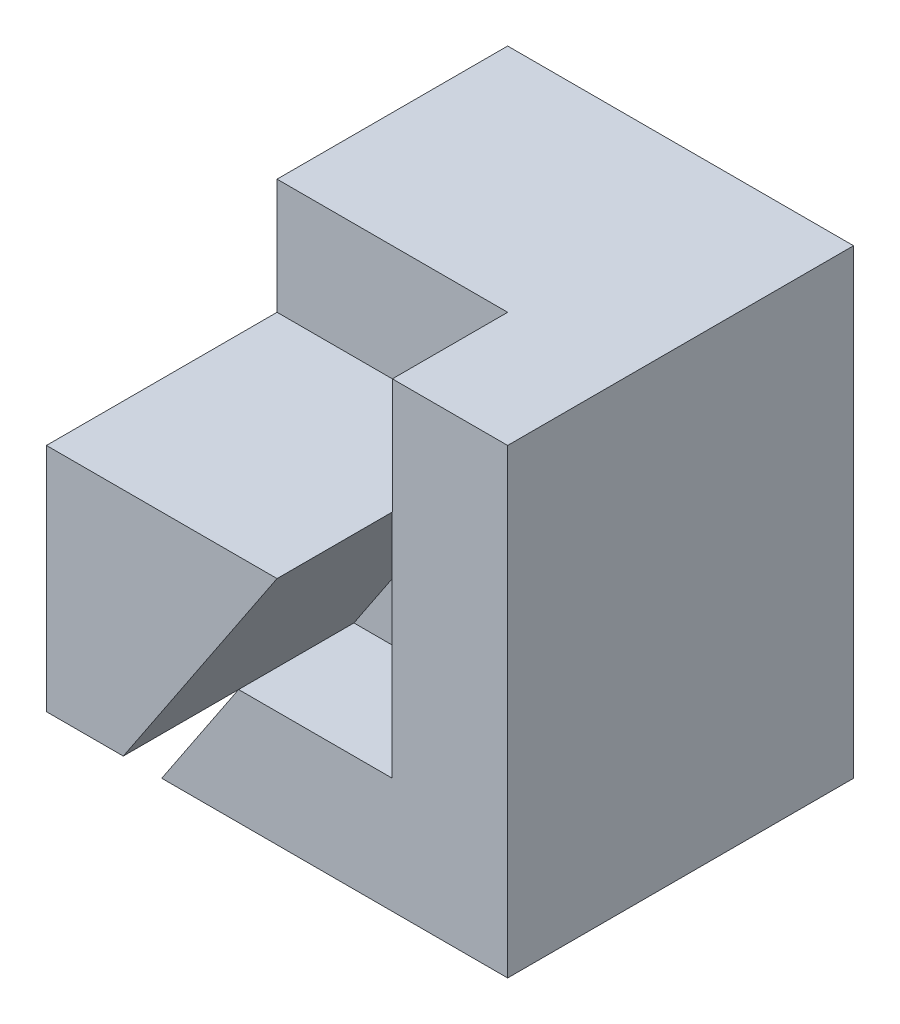
ISO-10303-21;
HEADER;
FILE_DESCRIPTION(('STEP AP214'),'2;1');
FILE_NAME('part.step','',(''),(''),'','','');
FILE_SCHEMA(('AUTOMOTIVE_DESIGN { 1 0 10303 214 1 1 1 1 }'));
ENDSEC;
DATA;
#1=APPLICATION_CONTEXT('core data for automotive mechanical design processes');
#2=APPLICATION_PROTOCOL_DEFINITION('international standard','automotive_design',2000,#1);
#3=PRODUCT_CONTEXT('',#1,'mechanical');
#4=PRODUCT('Part','Part','',(#3));
#5=PRODUCT_RELATED_PRODUCT_CATEGORY('part','',(#4));
#6=PRODUCT_DEFINITION_FORMATION('','',#4);
#7=PRODUCT_DEFINITION_CONTEXT('part definition',#1,'design');
#8=PRODUCT_DEFINITION('design','',#6,#7);
#9=PRODUCT_DEFINITION_SHAPE('','',#8);
#10=(LENGTH_UNIT() NAMED_UNIT(*) SI_UNIT(.MILLI.,.METRE.));
#11=(NAMED_UNIT(*) PLANE_ANGLE_UNIT() SI_UNIT($,.RADIAN.));
#12=(NAMED_UNIT(*) SI_UNIT($,.STERADIAN.) SOLID_ANGLE_UNIT());
#13=UNCERTAINTY_MEASURE_WITH_UNIT(LENGTH_MEASURE(1.E-05),#10,'distance_accuracy_value','');
#14=(GEOMETRIC_REPRESENTATION_CONTEXT(3) GLOBAL_UNCERTAINTY_ASSIGNED_CONTEXT((#13)) GLOBAL_UNIT_ASSIGNED_CONTEXT((#10,
#11,#12)) REPRESENTATION_CONTEXT('',''));
#15=CARTESIAN_POINT('',(0.,0.,0.));
#16=DIRECTION('',(0.,0.,1.));
#17=DIRECTION('',(1.,0.,0.));
#18=AXIS2_PLACEMENT_3D('',#15,#16,#17);
#19=CARTESIAN_POINT('',(40.,0.,30.));
#20=DIRECTION('',(0.,0.,-1.));
#21=DIRECTION('',(-1.,0.,0.));
#22=AXIS2_PLACEMENT_3D('',#19,#20,#21);
#23=PLANE('',#22);
#24=DIRECTION('',(0.554700196225229,0.832050294337844,0.));
#25=VECTOR('',#24,1.);
#26=CARTESIAN_POINT('',(16.6666666666667,10.,30.));
#27=LINE('',#26,#25);
#28=CARTESIAN_POINT('',(29.9666666666667,29.95,30.));
#29=VERTEX_POINT('',#28);
#30=CARTESIAN_POINT('',(30.,30.,30.));
#31=VERTEX_POINT('',#30);
#32=EDGE_CURVE('E173',#29,#31,#27,.T.);
#33=ORIENTED_EDGE('',*,*,#32,.F.);
#34=DIRECTION('',(0.,-1.,0.));
#35=VECTOR('',#34,1.);
#36=CARTESIAN_POINT('',(29.9666666666667,29.95,30.));
#37=LINE('',#36,#35);
#38=CARTESIAN_POINT('',(29.9666666666667,10.,30.));
#39=VERTEX_POINT('',#38);
#40=EDGE_CURVE('E183',#29,#39,#37,.T.);
#41=ORIENTED_EDGE('',*,*,#40,.T.);
#42=DIRECTION('',(1.,0.,0.));
#43=VECTOR('',#42,1.);
#44=CARTESIAN_POINT('',(30.,10.,30.));
#45=LINE('',#44,#43);
#46=CARTESIAN_POINT('',(16.6666666666667,10.,30.));
#47=VERTEX_POINT('',#46);
#48=EDGE_CURVE('E208',#47,#39,#45,.T.);
#49=ORIENTED_EDGE('',*,*,#48,.F.);
#50=DIRECTION('',(0.554700196225229,0.832050294337844,0.));
#51=VECTOR('',#50,1.);
#52=CARTESIAN_POINT('',(6.92307692307693,-4.61538461538461,30.));
#53=LINE('',#52,#51);
#54=CARTESIAN_POINT('',(16.666,9.99900000000001,30.));
#55=VERTEX_POINT('',#54);
#56=EDGE_CURVE('E197',#55,#47,#53,.T.);
#57=ORIENTED_EDGE('',*,*,#56,.F.);
#58=CARTESIAN_POINT('',(10.,0.,30.));
#59=VERTEX_POINT('',#58);
#60=EDGE_CURVE('E155',#59,#55,#53,.T.);
#61=ORIENTED_EDGE('',*,*,#60,.F.);
#62=DIRECTION('',(-1.,0.,0.));
#63=VECTOR('',#62,1.);
#64=CARTESIAN_POINT('',(40.,0.,30.));
#65=LINE('',#64,#63);
#66=CARTESIAN_POINT('',(40.,0.,30.));
#67=VERTEX_POINT('',#66);
#68=EDGE_CURVE('E251',#67,#59,#65,.T.);
#69=ORIENTED_EDGE('',*,*,#68,.F.);
#70=DIRECTION('',(0.,1.,0.));
#71=VECTOR('',#70,1.);
#72=CARTESIAN_POINT('',(40.,0.,30.));
#73=LINE('',#72,#71);
#74=CARTESIAN_POINT('',(40.,40.,30.));
#75=VERTEX_POINT('',#74);
#76=EDGE_CURVE('E254',#67,#75,#73,.T.);
#77=ORIENTED_EDGE('',*,*,#76,.T.);
#78=DIRECTION('',(-1.,0.,0.));
#79=VECTOR('',#78,1.);
#80=CARTESIAN_POINT('',(40.,40.,30.));
#81=LINE('',#80,#79);
#82=CARTESIAN_POINT('',(30.,40.,30.));
#83=VERTEX_POINT('',#82);
#84=EDGE_CURVE('E248',#75,#83,#81,.T.);
#85=ORIENTED_EDGE('',*,*,#84,.T.);
#86=DIRECTION('',(0.,1.,0.));
#87=VECTOR('',#86,1.);
#88=CARTESIAN_POINT('',(30.,0.,30.));
#89=LINE('',#88,#87);
#90=EDGE_CURVE('E257',#31,#83,#89,.T.);
#91=ORIENTED_EDGE('',*,*,#90,.F.);
#92=EDGE_LOOP('',(#33,#41,#49,#57,#61,#69,#77,#85,#91));
#93=FACE_BOUND('',#92,.T.);
#94=ADVANCED_FACE('F35',(#93),#23,.F.);
#95=CARTESIAN_POINT('',(10.,30.,30.));
#96=DIRECTION('',(0.,-1.,0.));
#97=DIRECTION('',(0.,0.,-1.));
#98=AXIS2_PLACEMENT_3D('',#95,#96,#97);
#99=PLANE('',#98);
#100=DIRECTION('',(0.,0.,-1.));
#101=VECTOR('',#100,1.);
#102=CARTESIAN_POINT('',(10.,30.,30.));
#103=LINE('',#102,#101);
#104=CARTESIAN_POINT('',(10.,30.,40.));
#105=VERTEX_POINT('',#104);
#106=CARTESIAN_POINT('',(10.,30.,20.));
#107=VERTEX_POINT('',#106);
#108=EDGE_CURVE('E58',#105,#107,#103,.T.);
#109=ORIENTED_EDGE('',*,*,#108,.F.);
#110=DIRECTION('',(-1.,0.,0.));
#111=VECTOR('',#110,1.);
#112=CARTESIAN_POINT('',(30.,30.,40.));
#113=LINE('',#112,#111);
#114=CARTESIAN_POINT('',(30.,30.,40.));
#115=VERTEX_POINT('',#114);
#116=EDGE_CURVE('E175',#115,#105,#113,.T.);
#117=ORIENTED_EDGE('',*,*,#116,.F.);
#118=DIRECTION('',(0.,0.,-1.));
#119=VECTOR('',#118,1.);
#120=CARTESIAN_POINT('',(30.,30.,40.));
#121=LINE('',#120,#119);
#122=EDGE_CURVE('E178',#115,#31,#121,.T.);
#123=ORIENTED_EDGE('',*,*,#122,.T.);
#124=DIRECTION('',(0.,0.,-1.));
#125=VECTOR('',#124,1.);
#126=CARTESIAN_POINT('',(30.,30.,30.));
#127=LINE('',#126,#125);
#128=CARTESIAN_POINT('',(30.,30.,20.));
#129=VERTEX_POINT('',#128);
#130=EDGE_CURVE('E216',#31,#129,#127,.T.);
#131=ORIENTED_EDGE('',*,*,#130,.T.);
#132=DIRECTION('',(-1.,0.,0.));
#133=VECTOR('',#132,1.);
#134=CARTESIAN_POINT('',(10.,30.,20.));
#135=LINE('',#134,#133);
#136=EDGE_CURVE('E212',#129,#107,#135,.T.);
#137=ORIENTED_EDGE('',*,*,#136,.T.);
#138=EDGE_LOOP('',(#109,#117,#123,#131,#137));
#139=FACE_BOUND('',#138,.T.);
#140=ADVANCED_FACE('F332',(#139),#99,.F.);
#141=CARTESIAN_POINT('',(0.,0.,40.));
#142=DIRECTION('',(0.,0.,-1.));
#143=DIRECTION('',(-1.,0.,0.));
#144=AXIS2_PLACEMENT_3D('',#141,#142,#143);
#145=PLANE('',#144);
#146=DIRECTION('',(0.,-1.,0.));
#147=VECTOR('',#146,1.);
#148=CARTESIAN_POINT('',(10.,0.,40.));
#149=LINE('',#148,#147);
#150=CARTESIAN_POINT('',(10.,9.999,40.));
#151=VERTEX_POINT('',#150);
#152=EDGE_CURVE('E203',#105,#151,#149,.T.);
#153=ORIENTED_EDGE('',*,*,#152,.T.);
#154=DIRECTION('',(-1.,0.,0.));
#155=VECTOR('',#154,1.);
#156=CARTESIAN_POINT('',(10.,9.999,40.));
#157=LINE('',#156,#155);
#158=CARTESIAN_POINT('',(16.666,9.999,40.));
#159=VERTEX_POINT('',#158);
#160=EDGE_CURVE('E168',#159,#151,#157,.T.);
#161=ORIENTED_EDGE('',*,*,#160,.F.);
#162=DIRECTION('',(0.554700196225229,0.832050294337844,0.));
#163=VECTOR('',#162,1.);
#164=CARTESIAN_POINT('',(6.92307692307693,-4.61538461538461,40.));
#165=LINE('',#164,#163);
#166=EDGE_CURVE('E206',#159,#115,#165,.T.);
#167=ORIENTED_EDGE('',*,*,#166,.T.);
#168=ORIENTED_EDGE('',*,*,#116,.T.);
#169=EDGE_LOOP('',(#153,#161,#167,#168));
#170=FACE_BOUND('',#169,.T.);
#171=ADVANCED_FACE('F334',(#170),#145,.F.);
#172=CARTESIAN_POINT('',(0.,0.,20.));
#173=DIRECTION('',(0.,0.,1.));
#174=DIRECTION('',(1.,0.,0.));
#175=AXIS2_PLACEMENT_3D('',#172,#173,#174);
#176=PLANE('',#175);
#177=DIRECTION('',(0.,-1.,0.));
#178=VECTOR('',#177,1.);
#179=CARTESIAN_POINT('',(10.,30.,20.));
#180=LINE('',#179,#178);
#181=CARTESIAN_POINT('',(10.,40.,20.));
#182=VERTEX_POINT('',#181);
#183=EDGE_CURVE('E222',#182,#107,#180,.T.);
#184=ORIENTED_EDGE('',*,*,#183,.T.);
#185=ORIENTED_EDGE('',*,*,#136,.F.);
#186=DIRECTION('',(0.,1.,0.));
#187=VECTOR('',#186,1.);
#188=CARTESIAN_POINT('',(30.,30.,20.));
#189=LINE('',#188,#187);
#190=CARTESIAN_POINT('',(30.,40.,20.));
#191=VERTEX_POINT('',#190);
#192=EDGE_CURVE('E224',#129,#191,#189,.T.);
#193=ORIENTED_EDGE('',*,*,#192,.T.);
#194=DIRECTION('',(-1.,0.,0.));
#195=VECTOR('',#194,1.);
#196=CARTESIAN_POINT('',(10.,40.,20.));
#197=LINE('',#196,#195);
#198=EDGE_CURVE('E219',#191,#182,#197,.T.);
#199=ORIENTED_EDGE('',*,*,#198,.T.);
#200=EDGE_LOOP('',(#184,#185,#193,#199));
#201=FACE_BOUND('',#200,.T.);
#202=ADVANCED_FACE('F337',(#201),#176,.T.);
#203=CARTESIAN_POINT('',(30.,40.,20.));
#204=DIRECTION('',(1.,0.,0.));
#205=DIRECTION('',(0.,0.,-1.));
#206=AXIS2_PLACEMENT_3D('',#203,#204,#205);
#207=PLANE('',#206);
#208=ORIENTED_EDGE('',*,*,#130,.F.);
#209=ORIENTED_EDGE('',*,*,#90,.T.);
#210=DIRECTION('',(0.,0.,1.));
#211=VECTOR('',#210,1.);
#212=CARTESIAN_POINT('',(30.,40.,20.));
#213=LINE('',#212,#211);
#214=EDGE_CURVE('E234',#191,#83,#213,.T.);
#215=ORIENTED_EDGE('',*,*,#214,.F.);
#216=ORIENTED_EDGE('',*,*,#192,.F.);
#217=EDGE_LOOP('',(#208,#209,#215,#216));
#218=FACE_BOUND('',#217,.T.);
#219=ADVANCED_FACE('F343',(#218),#207,.F.);
#220=CARTESIAN_POINT('',(10.,40.,0.));
#221=DIRECTION('',(1.,0.,0.));
#222=DIRECTION('',(0.,1.,0.));
#223=AXIS2_PLACEMENT_3D('',#220,#221,#222);
#224=PLANE('',#223);
#225=DIRECTION('',(0.,-1.,0.));
#226=VECTOR('',#225,1.);
#227=CARTESIAN_POINT('',(10.,0.,20.));
#228=LINE('',#227,#226);
#229=CARTESIAN_POINT('',(10.,9.999,20.));
#230=VERTEX_POINT('',#229);
#231=CARTESIAN_POINT('',(10.,0.,20.));
#232=VERTEX_POINT('',#231);
#233=EDGE_CURVE('E157',#230,#232,#228,.T.);
#234=ORIENTED_EDGE('',*,*,#233,.F.);
#235=DIRECTION('',(0.,0.,1.));
#236=VECTOR('',#235,1.);
#237=CARTESIAN_POINT('',(10.,9.999,20.));
#238=LINE('',#237,#236);
#239=EDGE_CURVE('E156',#230,#151,#238,.T.);
#240=ORIENTED_EDGE('',*,*,#239,.T.);
#241=ORIENTED_EDGE('',*,*,#152,.F.);
#242=ORIENTED_EDGE('',*,*,#108,.T.);
#243=ORIENTED_EDGE('',*,*,#183,.F.);
#244=DIRECTION('',(0.,0.,-1.));
#245=VECTOR('',#244,1.);
#246=CARTESIAN_POINT('',(10.,40.,10.));
#247=LINE('',#246,#245);
#248=CARTESIAN_POINT('',(10.,40.,0.));
#249=VERTEX_POINT('',#248);
#250=EDGE_CURVE('E232',#182,#249,#247,.T.);
#251=ORIENTED_EDGE('',*,*,#250,.T.);
#252=DIRECTION('',(0.,1.,0.));
#253=VECTOR('',#252,1.);
#254=CARTESIAN_POINT('',(10.,30.,0.));
#255=LINE('',#254,#253);
#256=CARTESIAN_POINT('',(10.,30.,0.));
#257=VERTEX_POINT('',#256);
#258=EDGE_CURVE('E226',#257,#249,#255,.T.);
#259=ORIENTED_EDGE('',*,*,#258,.F.);
#260=DIRECTION('',(0.,0.,1.));
#261=VECTOR('',#260,1.);
#262=CARTESIAN_POINT('',(10.,30.,0.));
#263=LINE('',#262,#261);
#264=CARTESIAN_POINT('',(10.,30.,10.));
#265=VERTEX_POINT('',#264);
#266=EDGE_CURVE('E264',#257,#265,#263,.T.);
#267=ORIENTED_EDGE('',*,*,#266,.T.);
#268=DIRECTION('',(0.,1.,0.));
#269=VECTOR('',#268,1.);
#270=CARTESIAN_POINT('',(10.,0.,10.));
#271=LINE('',#270,#269);
#272=CARTESIAN_POINT('',(10.,0.,10.));
#273=VERTEX_POINT('',#272);
#274=EDGE_CURVE('E244',#273,#265,#271,.T.);
#275=ORIENTED_EDGE('',*,*,#274,.F.);
#276=DIRECTION('',(0.,0.,-1.));
#277=VECTOR('',#276,1.);
#278=CARTESIAN_POINT('',(10.,0.,40.));
#279=LINE('',#278,#277);
#280=EDGE_CURVE('E237',#232,#273,#279,.T.);
#281=ORIENTED_EDGE('',*,*,#280,.F.);
#282=EDGE_LOOP('',(#234,#240,#241,#242,#243,#251,#259,#267,#275,#281));
#283=FACE_BOUND('',#282,.T.);
#284=ADVANCED_FACE('F299',(#283),#224,.F.);
#285=CARTESIAN_POINT('',(0.,40.,40.));
#286=DIRECTION('',(0.,-1.,0.));
#287=DIRECTION('',(0.,0.,-1.));
#288=AXIS2_PLACEMENT_3D('',#285,#286,#287);
#289=PLANE('',#288);
#290=ORIENTED_EDGE('',*,*,#198,.F.);
#291=ORIENTED_EDGE('',*,*,#214,.T.);
#292=ORIENTED_EDGE('',*,*,#84,.F.);
#293=DIRECTION('',(0.,0.,-1.));
#294=VECTOR('',#293,1.);
#295=CARTESIAN_POINT('',(40.,40.,40.));
#296=LINE('',#295,#294);
#297=CARTESIAN_POINT('',(40.,40.,0.));
#298=VERTEX_POINT('',#297);
#299=EDGE_CURVE('E277',#75,#298,#296,.T.);
#300=ORIENTED_EDGE('',*,*,#299,.T.);
#301=DIRECTION('',(1.,0.,0.));
#302=VECTOR('',#301,1.);
#303=CARTESIAN_POINT('',(40.,40.,0.));
#304=LINE('',#303,#302);
#305=EDGE_CURVE('E229',#249,#298,#304,.T.);
#306=ORIENTED_EDGE('',*,*,#305,.F.);
#307=ORIENTED_EDGE('',*,*,#250,.F.);
#308=EDGE_LOOP('',(#290,#291,#292,#300,#306,#307));
#309=FACE_BOUND('',#308,.T.);
#310=ADVANCED_FACE('F305',(#309),#289,.F.);
#311=CARTESIAN_POINT('',(0.,0.,40.));
#312=DIRECTION('',(0.,1.,0.));
#313=DIRECTION('',(0.,0.,1.));
#314=AXIS2_PLACEMENT_3D('',#311,#312,#313);
#315=PLANE('',#314);
#316=ORIENTED_EDGE('',*,*,#68,.T.);
#317=EDGE_CURVE('E238',#59,#232,#279,.T.);
#318=ORIENTED_EDGE('',*,*,#317,.T.);
#319=ORIENTED_EDGE('',*,*,#280,.T.);
#320=DIRECTION('',(-1.,0.,0.));
#321=VECTOR('',#320,1.);
#322=CARTESIAN_POINT('',(10.,0.,10.));
#323=LINE('',#322,#321);
#324=CARTESIAN_POINT('',(0.,0.,10.));
#325=VERTEX_POINT('',#324);
#326=EDGE_CURVE('E241',#273,#325,#323,.T.);
#327=ORIENTED_EDGE('',*,*,#326,.T.);
#328=DIRECTION('',(0.,0.,-1.));
#329=VECTOR('',#328,1.);
#330=CARTESIAN_POINT('',(0.,0.,40.));
#331=LINE('',#330,#329);
#332=CARTESIAN_POINT('',(0.,0.,0.));
#333=VERTEX_POINT('',#332);
#334=EDGE_CURVE('E281',#325,#333,#331,.T.);
#335=ORIENTED_EDGE('',*,*,#334,.T.);
#336=DIRECTION('',(1.,0.,0.));
#337=VECTOR('',#336,1.);
#338=CARTESIAN_POINT('',(0.,0.,0.));
#339=LINE('',#338,#337);
#340=CARTESIAN_POINT('',(40.,0.,0.));
#341=VERTEX_POINT('',#340);
#342=EDGE_CURVE('E271',#333,#341,#339,.T.);
#343=ORIENTED_EDGE('',*,*,#342,.T.);
#344=DIRECTION('',(0.,0.,-1.));
#345=VECTOR('',#344,1.);
#346=CARTESIAN_POINT('',(40.,0.,40.));
#347=LINE('',#346,#345);
#348=EDGE_CURVE('E279',#67,#341,#347,.T.);
#349=ORIENTED_EDGE('',*,*,#348,.F.);
#350=EDGE_LOOP('',(#316,#318,#319,#327,#335,#343,#349));
#351=FACE_BOUND('',#350,.T.);
#352=ADVANCED_FACE('F296',(#351),#315,.F.);
#353=CARTESIAN_POINT('',(0.,0.,40.));
#354=DIRECTION('',(1.,0.,0.));
#355=DIRECTION('',(0.,0.,-1.));
#356=AXIS2_PLACEMENT_3D('',#353,#354,#355);
#357=PLANE('',#356);
#358=ORIENTED_EDGE('',*,*,#334,.F.);
#359=DIRECTION('',(0.,1.,0.));
#360=VECTOR('',#359,1.);
#361=CARTESIAN_POINT('',(0.,0.,10.));
#362=LINE('',#361,#360);
#363=CARTESIAN_POINT('',(0.,30.,10.));
#364=VERTEX_POINT('',#363);
#365=EDGE_CURVE('E245',#325,#364,#362,.T.);
#366=ORIENTED_EDGE('',*,*,#365,.T.);
#367=DIRECTION('',(0.,0.,1.));
#368=VECTOR('',#367,1.);
#369=CARTESIAN_POINT('',(0.,30.,0.));
#370=LINE('',#369,#368);
#371=CARTESIAN_POINT('',(0.,30.,0.));
#372=VERTEX_POINT('',#371);
#373=EDGE_CURVE('E263',#372,#364,#370,.T.);
#374=ORIENTED_EDGE('',*,*,#373,.F.);
#375=DIRECTION('',(0.,-1.,0.));
#376=VECTOR('',#375,1.);
#377=CARTESIAN_POINT('',(0.,0.,0.));
#378=LINE('',#377,#376);
#379=EDGE_CURVE('E266',#372,#333,#378,.T.);
#380=ORIENTED_EDGE('',*,*,#379,.T.);
#381=EDGE_LOOP('',(#358,#366,#374,#380));
#382=FACE_BOUND('',#381,.T.);
#383=ADVANCED_FACE('F37',(#382),#357,.F.);
#384=CARTESIAN_POINT('',(40.,0.,40.));
#385=DIRECTION('',(-1.,0.,0.));
#386=DIRECTION('',(0.,0.,1.));
#387=AXIS2_PLACEMENT_3D('',#384,#385,#386);
#388=PLANE('',#387);
#389=ORIENTED_EDGE('',*,*,#299,.F.);
#390=ORIENTED_EDGE('',*,*,#76,.F.);
#391=ORIENTED_EDGE('',*,*,#348,.T.);
#392=DIRECTION('',(0.,1.,0.));
#393=VECTOR('',#392,1.);
#394=CARTESIAN_POINT('',(40.,0.,0.));
#395=LINE('',#394,#393);
#396=EDGE_CURVE('E274',#341,#298,#395,.T.);
#397=ORIENTED_EDGE('',*,*,#396,.T.);
#398=EDGE_LOOP('',(#389,#390,#391,#397));
#399=FACE_BOUND('',#398,.T.);
#400=ADVANCED_FACE('F310',(#399),#388,.F.);
#401=CARTESIAN_POINT('',(0.,0.,0.));
#402=DIRECTION('',(0.,0.,-1.));
#403=DIRECTION('',(-1.,0.,0.));
#404=AXIS2_PLACEMENT_3D('',#401,#402,#403);
#405=PLANE('',#404);
#406=DIRECTION('',(1.,0.,0.));
#407=VECTOR('',#406,1.);
#408=CARTESIAN_POINT('',(0.,30.,0.));
#409=LINE('',#408,#407);
#410=EDGE_CURVE('E259',#372,#257,#409,.T.);
#411=ORIENTED_EDGE('',*,*,#410,.T.);
#412=ORIENTED_EDGE('',*,*,#258,.T.);
#413=ORIENTED_EDGE('',*,*,#305,.T.);
#414=ORIENTED_EDGE('',*,*,#396,.F.);
#415=ORIENTED_EDGE('',*,*,#342,.F.);
#416=ORIENTED_EDGE('',*,*,#379,.F.);
#417=EDGE_LOOP('',(#411,#412,#413,#414,#415,#416));
#418=FACE_BOUND('',#417,.T.);
#419=ADVANCED_FACE('F302',(#418),#405,.T.);
#420=CARTESIAN_POINT('',(0.,30.,0.));
#421=DIRECTION('',(0.,-1.,0.));
#422=DIRECTION('',(0.,0.,-1.));
#423=AXIS2_PLACEMENT_3D('',#420,#421,#422);
#424=PLANE('',#423);
#425=ORIENTED_EDGE('',*,*,#373,.T.);
#426=DIRECTION('',(1.,0.,0.));
#427=VECTOR('',#426,1.);
#428=CARTESIAN_POINT('',(0.,30.,10.));
#429=LINE('',#428,#427);
#430=EDGE_CURVE('E43',#364,#265,#429,.T.);
#431=ORIENTED_EDGE('',*,*,#430,.T.);
#432=ORIENTED_EDGE('',*,*,#266,.F.);
#433=ORIENTED_EDGE('',*,*,#410,.F.);
#434=EDGE_LOOP('',(#425,#431,#432,#433));
#435=FACE_BOUND('',#434,.T.);
#436=ADVANCED_FACE('F285',(#435),#424,.F.);
#437=CARTESIAN_POINT('',(10.,0.,10.));
#438=DIRECTION('',(0.,0.,-1.));
#439=DIRECTION('',(-1.,0.,0.));
#440=AXIS2_PLACEMENT_3D('',#437,#438,#439);
#441=PLANE('',#440);
#442=ORIENTED_EDGE('',*,*,#365,.F.);
#443=ORIENTED_EDGE('',*,*,#326,.F.);
#444=ORIENTED_EDGE('',*,*,#274,.T.);
#445=ORIENTED_EDGE('',*,*,#430,.F.);
#446=EDGE_LOOP('',(#442,#443,#444,#445));
#447=FACE_BOUND('',#446,.T.);
#448=ADVANCED_FACE('F288',(#447),#441,.F.);
#449=CARTESIAN_POINT('',(6.92307692307693,-4.61538461538461,40.));
#450=DIRECTION('',(-0.832050294337844,0.554700196225229,0.));
#451=DIRECTION('',(-0.554700196225229,-0.832050294337844,0.));
#452=AXIS2_PLACEMENT_3D('',#449,#450,#451);
#453=PLANE('',#452);
#454=ORIENTED_EDGE('',*,*,#166,.F.);
#455=DIRECTION('',(0.,0.,-1.));
#456=VECTOR('',#455,1.);
#457=CARTESIAN_POINT('',(16.666,9.999,40.));
#458=LINE('',#457,#456);
#459=EDGE_CURVE('E11',#159,#55,#458,.T.);
#460=ORIENTED_EDGE('',*,*,#459,.T.);
#461=ORIENTED_EDGE('',*,*,#56,.T.);
#462=DIRECTION('',(0.,0.,1.));
#463=VECTOR('',#462,1.);
#464=CARTESIAN_POINT('',(16.6666666666667,10.,20.));
#465=LINE('',#464,#463);
#466=CARTESIAN_POINT('',(16.6666666666667,10.,20.));
#467=VERTEX_POINT('',#466);
#468=EDGE_CURVE('E194',#467,#47,#465,.T.);
#469=ORIENTED_EDGE('',*,*,#468,.F.);
#470=DIRECTION('',(0.554700196225229,0.832050294337844,0.));
#471=VECTOR('',#470,1.);
#472=CARTESIAN_POINT('',(6.92307692307692,-4.61538461538461,20.));
#473=LINE('',#472,#471);
#474=CARTESIAN_POINT('',(29.9666666666667,29.95,20.));
#475=VERTEX_POINT('',#474);
#476=EDGE_CURVE('E191',#467,#475,#473,.T.);
#477=ORIENTED_EDGE('',*,*,#476,.T.);
#478=DIRECTION('',(0.,0.,1.));
#479=VECTOR('',#478,1.);
#480=CARTESIAN_POINT('',(29.9666666666667,29.95,20.));
#481=LINE('',#480,#479);
#482=EDGE_CURVE('E198',#475,#29,#481,.T.);
#483=ORIENTED_EDGE('',*,*,#482,.T.);
#484=ORIENTED_EDGE('',*,*,#32,.T.);
#485=ORIENTED_EDGE('',*,*,#122,.F.);
#486=EDGE_LOOP('',(#454,#460,#461,#469,#477,#483,#484,#485));
#487=FACE_BOUND('',#486,.T.);
#488=ADVANCED_FACE('F316',(#487),#453,.F.);
#489=CARTESIAN_POINT('',(0.,10.,20.));
#490=DIRECTION('',(0.,-1.,0.));
#491=DIRECTION('',(0.,0.,-1.));
#492=AXIS2_PLACEMENT_3D('',#489,#490,#491);
#493=PLANE('',#492);
#494=DIRECTION('',(0.,0.,1.));
#495=VECTOR('',#494,1.);
#496=CARTESIAN_POINT('',(29.9666666666667,10.,20.));
#497=LINE('',#496,#495);
#498=CARTESIAN_POINT('',(29.9666666666667,10.,20.));
#499=VERTEX_POINT('',#498);
#500=EDGE_CURVE('E193',#499,#39,#497,.T.);
#501=ORIENTED_EDGE('',*,*,#500,.F.);
#502=DIRECTION('',(1.,0.,0.));
#503=VECTOR('',#502,1.);
#504=CARTESIAN_POINT('',(0.,10.,20.));
#505=LINE('',#504,#503);
#506=EDGE_CURVE('E185',#467,#499,#505,.T.);
#507=ORIENTED_EDGE('',*,*,#506,.F.);
#508=ORIENTED_EDGE('',*,*,#468,.T.);
#509=ORIENTED_EDGE('',*,*,#48,.T.);
#510=EDGE_LOOP('',(#501,#507,#508,#509));
#511=FACE_BOUND('',#510,.T.);
#512=ADVANCED_FACE('F320',(#511),#493,.F.);
#513=CARTESIAN_POINT('',(29.9666666666667,0.,20.));
#514=DIRECTION('',(1.,0.,0.));
#515=DIRECTION('',(0.,0.,-1.));
#516=AXIS2_PLACEMENT_3D('',#513,#514,#515);
#517=PLANE('',#516);
#518=ORIENTED_EDGE('',*,*,#500,.T.);
#519=ORIENTED_EDGE('',*,*,#40,.F.);
#520=ORIENTED_EDGE('',*,*,#482,.F.);
#521=DIRECTION('',(0.,1.,0.));
#522=VECTOR('',#521,1.);
#523=CARTESIAN_POINT('',(29.9666666666667,0.,20.));
#524=LINE('',#523,#522);
#525=EDGE_CURVE('E188',#499,#475,#524,.T.);
#526=ORIENTED_EDGE('',*,*,#525,.F.);
#527=EDGE_LOOP('',(#518,#519,#520,#526));
#528=FACE_BOUND('',#527,.T.);
#529=ADVANCED_FACE('F327',(#528),#517,.F.);
#530=CARTESIAN_POINT('',(0.,0.,20.));
#531=DIRECTION('',(0.,0.,1.));
#532=DIRECTION('',(1.,0.,0.));
#533=AXIS2_PLACEMENT_3D('',#530,#531,#532);
#534=PLANE('',#533);
#535=ORIENTED_EDGE('',*,*,#506,.T.);
#536=ORIENTED_EDGE('',*,*,#525,.T.);
#537=ORIENTED_EDGE('',*,*,#476,.F.);
#538=EDGE_LOOP('',(#535,#536,#537));
#539=FACE_BOUND('',#538,.T.);
#540=ADVANCED_FACE('F323',(#539),#534,.T.);
#541=CARTESIAN_POINT('',(16.666,9.999,20.));
#542=DIRECTION('',(0.832050294337844,-0.554700196225229,0.));
#543=DIRECTION('',(0.554700196225229,0.832050294337844,0.));
#544=AXIS2_PLACEMENT_3D('',#541,#542,#543);
#545=PLANE('',#544);
#546=DIRECTION('',(0.,0.,1.));
#547=VECTOR('',#546,1.);
#548=CARTESIAN_POINT('',(16.666,9.999,20.));
#549=LINE('',#548,#547);
#550=CARTESIAN_POINT('',(16.666,9.999,20.));
#551=VERTEX_POINT('',#550);
#552=EDGE_CURVE('E50',#551,#55,#549,.T.);
#553=ORIENTED_EDGE('',*,*,#552,.F.);
#554=DIRECTION('',(0.554700196225229,0.832050294337844,0.));
#555=VECTOR('',#554,1.);
#556=CARTESIAN_POINT('',(16.666,9.999,20.));
#557=LINE('',#556,#555);
#558=EDGE_CURVE('E152',#232,#551,#557,.T.);
#559=ORIENTED_EDGE('',*,*,#558,.F.);
#560=ORIENTED_EDGE('',*,*,#317,.F.);
#561=ORIENTED_EDGE('',*,*,#60,.T.);
#562=EDGE_LOOP('',(#553,#559,#560,#561));
#563=FACE_BOUND('',#562,.T.);
#564=ADVANCED_FACE('F150',(#563),#545,.F.);
#565=CARTESIAN_POINT('',(10.,9.999,20.));
#566=DIRECTION('',(0.,1.,0.));
#567=DIRECTION('',(0.,0.,1.));
#568=AXIS2_PLACEMENT_3D('',#565,#566,#567);
#569=PLANE('',#568);
#570=ORIENTED_EDGE('',*,*,#160,.T.);
#571=ORIENTED_EDGE('',*,*,#239,.F.);
#572=DIRECTION('',(-1.,0.,0.));
#573=VECTOR('',#572,1.);
#574=CARTESIAN_POINT('',(10.,9.999,20.));
#575=LINE('',#574,#573);
#576=EDGE_CURVE('E160',#551,#230,#575,.T.);
#577=ORIENTED_EDGE('',*,*,#576,.F.);
#578=ORIENTED_EDGE('',*,*,#552,.T.);
#579=ORIENTED_EDGE('',*,*,#459,.F.);
#580=EDGE_LOOP('',(#570,#571,#577,#578,#579));
#581=FACE_BOUND('',#580,.T.);
#582=ADVANCED_FACE('F161',(#581),#569,.F.);
#583=CARTESIAN_POINT('',(0.,0.,20.));
#584=DIRECTION('',(0.,0.,1.));
#585=DIRECTION('',(1.,0.,0.));
#586=AXIS2_PLACEMENT_3D('',#583,#584,#585);
#587=PLANE('',#586);
#588=ORIENTED_EDGE('',*,*,#558,.T.);
#589=ORIENTED_EDGE('',*,*,#576,.T.);
#590=ORIENTED_EDGE('',*,*,#233,.T.);
#591=EDGE_LOOP('',(#588,#589,#590));
#592=FACE_BOUND('',#591,.T.);
#593=ADVANCED_FACE('F166',(#592),#587,.T.);
#594=CLOSED_SHELL('',(#94,#140,#171,#202,#219,#284,#310,#352,#383,#400,#419,#436,#448,#488,#512,
#529,#540,#564,#582,#593));
#595=MANIFOLD_SOLID_BREP('B2',#594);
#596=ADVANCED_BREP_SHAPE_REPRESENTATION('',(#18,#595),#14);
#597=SHAPE_DEFINITION_REPRESENTATION(#9,#596);
ENDSEC;
END-ISO-10303-21;
